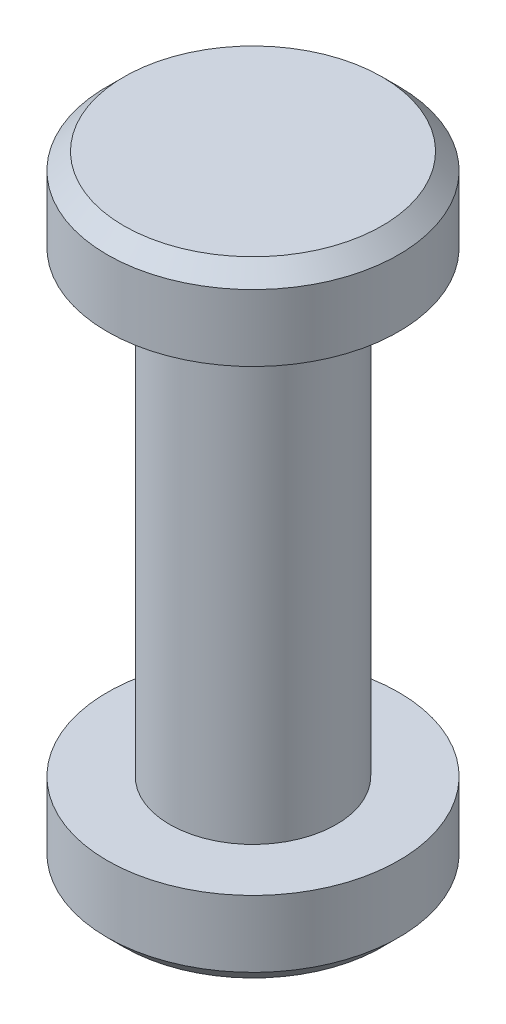
ISO-10303-21;
HEADER;
FILE_DESCRIPTION(('STEP AP214'),'2;1');
FILE_NAME('part.step','',(''),(''),'','','');
FILE_SCHEMA(('AUTOMOTIVE_DESIGN { 1 0 10303 214 1 1 1 1 }'));
ENDSEC;
DATA;
#1=APPLICATION_CONTEXT('core data for automotive mechanical design processes');
#2=APPLICATION_PROTOCOL_DEFINITION('international standard','automotive_design',2000,#1);
#3=PRODUCT_CONTEXT('',#1,'mechanical');
#4=PRODUCT('Part','Part','',(#3));
#5=PRODUCT_RELATED_PRODUCT_CATEGORY('part','',(#4));
#6=PRODUCT_DEFINITION_FORMATION('','',#4);
#7=PRODUCT_DEFINITION_CONTEXT('part definition',#1,'design');
#8=PRODUCT_DEFINITION('design','',#6,#7);
#9=PRODUCT_DEFINITION_SHAPE('','',#8);
#10=(LENGTH_UNIT() NAMED_UNIT(*) SI_UNIT(.MILLI.,.METRE.));
#11=(NAMED_UNIT(*) PLANE_ANGLE_UNIT() SI_UNIT($,.RADIAN.));
#12=(NAMED_UNIT(*) SI_UNIT($,.STERADIAN.) SOLID_ANGLE_UNIT());
#13=UNCERTAINTY_MEASURE_WITH_UNIT(LENGTH_MEASURE(1.E-05),#10,'distance_accuracy_value','');
#14=(GEOMETRIC_REPRESENTATION_CONTEXT(3) GLOBAL_UNCERTAINTY_ASSIGNED_CONTEXT((#13)) GLOBAL_UNIT_ASSIGNED_CONTEXT((#10,
#11,#12)) REPRESENTATION_CONTEXT('',''));
#15=CARTESIAN_POINT('',(0.,0.,0.));
#16=DIRECTION('',(0.,0.,1.));
#17=DIRECTION('',(1.,0.,0.));
#18=AXIS2_PLACEMENT_3D('',#15,#16,#17);
#19=CARTESIAN_POINT('',(0.,5.5,0.));
#20=DIRECTION('',(0.,-1.,0.));
#21=DIRECTION('',(0.,0.,-1.));
#22=AXIS2_PLACEMENT_3D('',#19,#20,#21);
#23=CYLINDRICAL_SURFACE('',#22,1.);
#24=CARTESIAN_POINT('',(0.,5.5,0.));
#25=DIRECTION('',(0.,1.,0.));
#26=DIRECTION('',(0.,0.,1.));
#27=AXIS2_PLACEMENT_3D('',#24,#25,#26);
#28=CIRCLE('',#27,1.);
#29=CARTESIAN_POINT('',(0.,5.5,1.));
#30=VERTEX_POINT('',#29);
#31=EDGE_CURVE('E64',#30,#30,#28,.T.);
#32=ORIENTED_EDGE('',*,*,#31,.F.);
#33=EDGE_LOOP('',(#32));
#34=FACE_BOUND('',#33,.T.);
#35=CARTESIAN_POINT('',(0.,0.,0.));
#36=DIRECTION('',(0.,1.,0.));
#37=DIRECTION('',(0.,0.,1.));
#38=AXIS2_PLACEMENT_3D('',#35,#36,#37);
#39=CIRCLE('',#38,1.);
#40=CARTESIAN_POINT('',(0.,0.,1.));
#41=VERTEX_POINT('',#40);
#42=EDGE_CURVE('E65',#41,#41,#39,.T.);
#43=ORIENTED_EDGE('',*,*,#42,.T.);
#44=EDGE_LOOP('',(#43));
#45=FACE_BOUND('',#44,.T.);
#46=ADVANCED_FACE('F39',(#34,#45),#23,.T.);
#47=CARTESIAN_POINT('',(0.,6.5,0.));
#48=DIRECTION('',(0.,-1.,0.));
#49=DIRECTION('',(0.,0.,-1.));
#50=AXIS2_PLACEMENT_3D('',#47,#48,#49);
#51=CYLINDRICAL_SURFACE('',#50,1.75);
#52=CARTESIAN_POINT('',(0.,6.3,0.));
#53=DIRECTION('',(0.,1.,0.));
#54=DIRECTION('',(0.,0.,1.));
#55=AXIS2_PLACEMENT_3D('',#52,#53,#54);
#56=CIRCLE('',#55,1.75);
#57=CARTESIAN_POINT('',(0.,6.3,1.75));
#58=VERTEX_POINT('',#57);
#59=EDGE_CURVE('E53',#58,#58,#56,.F.);
#60=ORIENTED_EDGE('',*,*,#59,.T.);
#61=EDGE_LOOP('',(#60));
#62=FACE_BOUND('',#61,.T.);
#63=CARTESIAN_POINT('',(0.,5.5,0.));
#64=DIRECTION('',(0.,1.,0.));
#65=DIRECTION('',(0.,0.,1.));
#66=AXIS2_PLACEMENT_3D('',#63,#64,#65);
#67=CIRCLE('',#66,1.75);
#68=CARTESIAN_POINT('',(0.,5.5,1.75));
#69=VERTEX_POINT('',#68);
#70=EDGE_CURVE('E69',#69,#69,#67,.T.);
#71=ORIENTED_EDGE('',*,*,#70,.T.);
#72=EDGE_LOOP('',(#71));
#73=FACE_BOUND('',#72,.T.);
#74=ADVANCED_FACE('F97',(#62,#73),#51,.T.);
#75=CARTESIAN_POINT('',(0.,6.5,0.));
#76=DIRECTION('',(0.,1.,0.));
#77=DIRECTION('',(0.,0.,1.));
#78=AXIS2_PLACEMENT_3D('',#75,#76,#77);
#79=PLANE('',#78);
#80=CARTESIAN_POINT('',(0.,6.5,0.));
#81=DIRECTION('',(0.,1.,0.));
#82=DIRECTION('',(0.,0.,1.));
#83=AXIS2_PLACEMENT_3D('',#80,#81,#82);
#84=CIRCLE('',#83,1.55);
#85=CARTESIAN_POINT('',(0.,6.5,1.55));
#86=VERTEX_POINT('',#85);
#87=EDGE_CURVE('E58',#86,#86,#84,.T.);
#88=ORIENTED_EDGE('',*,*,#87,.T.);
#89=EDGE_LOOP('',(#88));
#90=FACE_BOUND('',#89,.T.);
#91=ADVANCED_FACE('F103',(#90),#79,.T.);
#92=CARTESIAN_POINT('',(0.,5.5,0.));
#93=DIRECTION('',(0.,1.,0.));
#94=DIRECTION('',(0.,0.,1.));
#95=AXIS2_PLACEMENT_3D('',#92,#93,#94);
#96=PLANE('',#95);
#97=ORIENTED_EDGE('',*,*,#31,.T.);
#98=EDGE_LOOP('',(#97));
#99=FACE_BOUND('',#98,.T.);
#100=ORIENTED_EDGE('',*,*,#70,.F.);
#101=EDGE_LOOP('',(#100));
#102=FACE_BOUND('',#101,.T.);
#103=ADVANCED_FACE('F114',(#99,#102),#96,.F.);
#104=CARTESIAN_POINT('',(0.,6.5,0.));
#105=DIRECTION('',(0.,-1.,0.));
#106=DIRECTION('',(0.,0.,-1.));
#107=AXIS2_PLACEMENT_3D('',#104,#105,#106);
#108=CONICAL_SURFACE('',#107,1.55,0.785398163397447);
#109=ORIENTED_EDGE('',*,*,#59,.F.);
#110=EDGE_LOOP('',(#109));
#111=FACE_BOUND('',#110,.T.);
#112=ORIENTED_EDGE('',*,*,#87,.F.);
#113=EDGE_LOOP('',(#112));
#114=FACE_BOUND('',#113,.T.);
#115=ADVANCED_FACE('F110',(#111,#114),#108,.T.);
#116=CARTESIAN_POINT('',(0.,-1.,0.));
#117=DIRECTION('',(0.,1.,0.));
#118=DIRECTION('',(0.,0.,1.));
#119=AXIS2_PLACEMENT_3D('',#116,#117,#118);
#120=CYLINDRICAL_SURFACE('',#119,1.75);
#121=CARTESIAN_POINT('',(0.,-0.800000000000001,0.));
#122=DIRECTION('',(0.,-1.,0.));
#123=DIRECTION('',(0.,0.,-1.));
#124=AXIS2_PLACEMENT_3D('',#121,#122,#123);
#125=CIRCLE('',#124,1.75);
#126=CARTESIAN_POINT('',(0.,-0.800000000000001,-1.75));
#127=VERTEX_POINT('',#126);
#128=EDGE_CURVE('E10',#127,#127,#125,.F.);
#129=ORIENTED_EDGE('',*,*,#128,.T.);
#130=EDGE_LOOP('',(#129));
#131=FACE_BOUND('',#130,.T.);
#132=CARTESIAN_POINT('',(0.,0.,0.));
#133=DIRECTION('',(0.,-1.,0.));
#134=DIRECTION('',(0.,0.,-1.));
#135=AXIS2_PLACEMENT_3D('',#132,#133,#134);
#136=CIRCLE('',#135,1.75);
#137=CARTESIAN_POINT('',(0.,0.,-1.75));
#138=VERTEX_POINT('',#137);
#139=EDGE_CURVE('E70',#138,#138,#136,.T.);
#140=ORIENTED_EDGE('',*,*,#139,.T.);
#141=EDGE_LOOP('',(#140));
#142=FACE_BOUND('',#141,.T.);
#143=ADVANCED_FACE('F81',(#131,#142),#120,.T.);
#144=CARTESIAN_POINT('',(0.,-1.,0.));
#145=DIRECTION('',(0.,-1.,0.));
#146=DIRECTION('',(0.,0.,-1.));
#147=AXIS2_PLACEMENT_3D('',#144,#145,#146);
#148=PLANE('',#147);
#149=CARTESIAN_POINT('',(0.,-1.,0.));
#150=DIRECTION('',(0.,-1.,0.));
#151=DIRECTION('',(0.,0.,-1.));
#152=AXIS2_PLACEMENT_3D('',#149,#150,#151);
#153=CIRCLE('',#152,1.55);
#154=CARTESIAN_POINT('',(0.,-1.,-1.55));
#155=VERTEX_POINT('',#154);
#156=EDGE_CURVE('E48',#155,#155,#153,.T.);
#157=ORIENTED_EDGE('',*,*,#156,.T.);
#158=EDGE_LOOP('',(#157));
#159=FACE_BOUND('',#158,.T.);
#160=ADVANCED_FACE('F85',(#159),#148,.T.);
#161=CARTESIAN_POINT('',(0.,0.,0.));
#162=DIRECTION('',(0.,-1.,0.));
#163=DIRECTION('',(0.,0.,-1.));
#164=AXIS2_PLACEMENT_3D('',#161,#162,#163);
#165=PLANE('',#164);
#166=ORIENTED_EDGE('',*,*,#42,.F.);
#167=EDGE_LOOP('',(#166));
#168=FACE_BOUND('',#167,.T.);
#169=ORIENTED_EDGE('',*,*,#139,.F.);
#170=EDGE_LOOP('',(#169));
#171=FACE_BOUND('',#170,.T.);
#172=ADVANCED_FACE('F83',(#168,#171),#165,.F.);
#173=CARTESIAN_POINT('',(0.,-1.,0.));
#174=DIRECTION('',(0.,1.,0.));
#175=DIRECTION('',(0.,0.,1.));
#176=AXIS2_PLACEMENT_3D('',#173,#174,#175);
#177=CONICAL_SURFACE('',#176,1.55,0.785398163397448);
#178=ORIENTED_EDGE('',*,*,#128,.F.);
#179=EDGE_LOOP('',(#178));
#180=FACE_BOUND('',#179,.T.);
#181=ORIENTED_EDGE('',*,*,#156,.F.);
#182=EDGE_LOOP('',(#181));
#183=FACE_BOUND('',#182,.T.);
#184=ADVANCED_FACE('F42',(#180,#183),#177,.T.);
#185=CLOSED_SHELL('',(#46,#74,#91,#103,#115,#143,#160,#172,#184));
#186=MANIFOLD_SOLID_BREP('B2',#185);
#187=ADVANCED_BREP_SHAPE_REPRESENTATION('',(#18,#186),#14);
#188=SHAPE_DEFINITION_REPRESENTATION(#9,#187);
ENDSEC;
END-ISO-10303-21;
